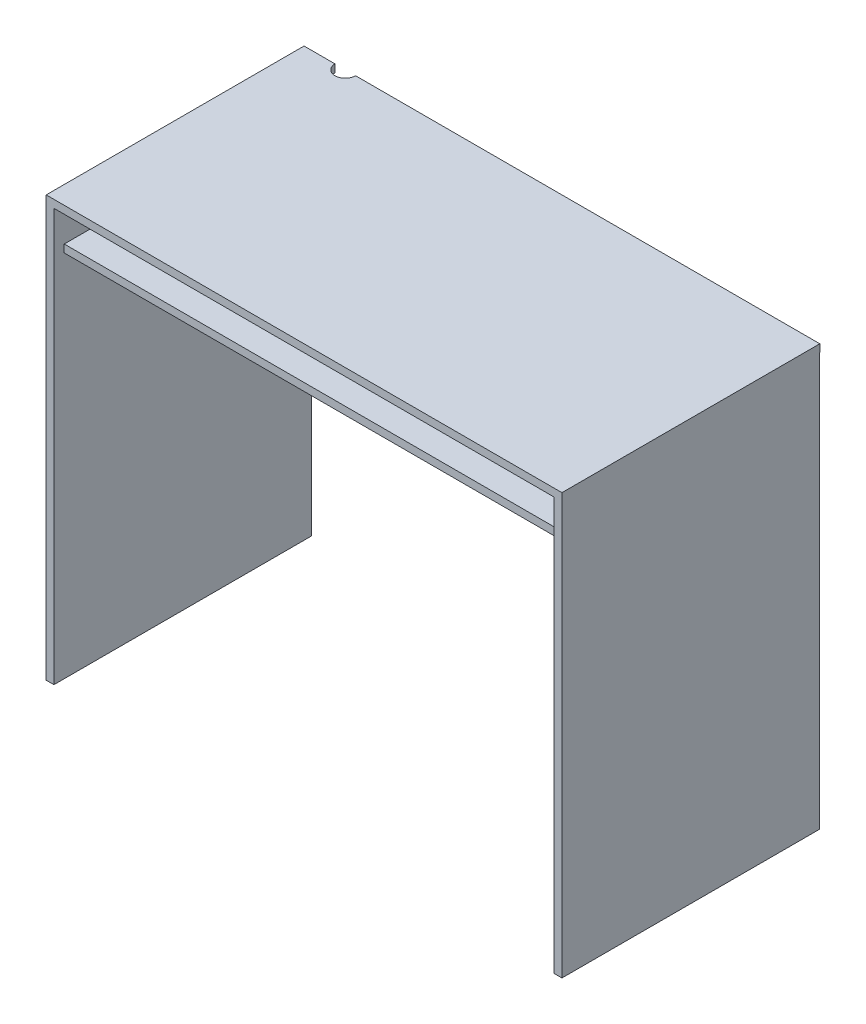
ISO-10303-21;
HEADER;
FILE_DESCRIPTION(('STEP AP214'),'2;1');
FILE_NAME('part.step','',(''),(''),'','','');
FILE_SCHEMA(('AUTOMOTIVE_DESIGN { 1 0 10303 214 1 1 1 1 }'));
ENDSEC;
DATA;
#1=APPLICATION_CONTEXT('core data for automotive mechanical design processes');
#2=APPLICATION_PROTOCOL_DEFINITION('international standard','automotive_design',2000,#1);
#3=PRODUCT_CONTEXT('',#1,'mechanical');
#4=PRODUCT('Part','Part','',(#3));
#5=PRODUCT_RELATED_PRODUCT_CATEGORY('part','',(#4));
#6=PRODUCT_DEFINITION_FORMATION('','',#4);
#7=PRODUCT_DEFINITION_CONTEXT('part definition',#1,'design');
#8=PRODUCT_DEFINITION('design','',#6,#7);
#9=PRODUCT_DEFINITION_SHAPE('','',#8);
#10=(LENGTH_UNIT() NAMED_UNIT(*) SI_UNIT(.MILLI.,.METRE.));
#11=(NAMED_UNIT(*) PLANE_ANGLE_UNIT() SI_UNIT($,.RADIAN.));
#12=(NAMED_UNIT(*) SI_UNIT($,.STERADIAN.) SOLID_ANGLE_UNIT());
#13=UNCERTAINTY_MEASURE_WITH_UNIT(LENGTH_MEASURE(1.E-05),#10,'distance_accuracy_value','');
#14=(GEOMETRIC_REPRESENTATION_CONTEXT(3) GLOBAL_UNCERTAINTY_ASSIGNED_CONTEXT((#13)) GLOBAL_UNIT_ASSIGNED_CONTEXT((#10,
#11,#12)) REPRESENTATION_CONTEXT('',''));
#15=CARTESIAN_POINT('',(0.,0.,0.));
#16=DIRECTION('',(0.,0.,1.));
#17=DIRECTION('',(1.,0.,0.));
#18=AXIS2_PLACEMENT_3D('',#15,#16,#17);
#19=CARTESIAN_POINT('',(-500.,15.,-250.));
#20=DIRECTION('',(0.,0.,1.));
#21=DIRECTION('',(1.,0.,0.));
#22=AXIS2_PLACEMENT_3D('',#19,#20,#21);
#23=PLANE('',#22);
#24=DIRECTION('',(-1.,0.,0.));
#25=VECTOR('',#24,1.);
#26=CARTESIAN_POINT('',(-500.,0.,-250.));
#27=LINE('',#26,#25);
#28=CARTESIAN_POINT('',(500.,0.,-250.));
#29=VERTEX_POINT('',#28);
#30=CARTESIAN_POINT('',(-400.,0.,-250.));
#31=VERTEX_POINT('',#30);
#32=EDGE_CURVE('E162',#29,#31,#27,.T.);
#33=ORIENTED_EDGE('',*,*,#32,.T.);
#34=DIRECTION('',(0.,1.,0.));
#35=VECTOR('',#34,1.);
#36=CARTESIAN_POINT('',(-400.,-800.,-250.));
#37=LINE('',#36,#35);
#38=CARTESIAN_POINT('',(-400.,15.,-250.));
#39=VERTEX_POINT('',#38);
#40=EDGE_CURVE('E151',#31,#39,#37,.T.);
#41=ORIENTED_EDGE('',*,*,#40,.T.);
#42=DIRECTION('',(-1.,0.,0.));
#43=VECTOR('',#42,1.);
#44=CARTESIAN_POINT('',(-500.,15.,-250.));
#45=LINE('',#44,#43);
#46=CARTESIAN_POINT('',(500.,15.,-250.));
#47=VERTEX_POINT('',#46);
#48=EDGE_CURVE('E159',#47,#39,#45,.T.);
#49=ORIENTED_EDGE('',*,*,#48,.F.);
#50=DIRECTION('',(0.,-1.,0.));
#51=VECTOR('',#50,1.);
#52=CARTESIAN_POINT('',(500.,15.,-250.));
#53=LINE('',#52,#51);
#54=EDGE_CURVE('E48',#47,#29,#53,.T.);
#55=ORIENTED_EDGE('',*,*,#54,.T.);
#56=EDGE_LOOP('',(#33,#41,#49,#55));
#57=FACE_BOUND('',#56,.T.);
#58=ADVANCED_FACE('F39',(#57),#23,.F.);
#59=CARTESIAN_POINT('',(-485.,-800.,250.));
#60=DIRECTION('',(-1.,0.,0.));
#61=DIRECTION('',(0.,0.,1.));
#62=AXIS2_PLACEMENT_3D('',#59,#60,#61);
#63=PLANE('',#62);
#64=DIRECTION('',(0.,0.,1.));
#65=VECTOR('',#64,1.);
#66=CARTESIAN_POINT('',(-485.,0.,250.));
#67=LINE('',#66,#65);
#68=CARTESIAN_POINT('',(-485.,0.,-249.509580663374));
#69=VERTEX_POINT('',#68);
#70=CARTESIAN_POINT('',(-485.,0.,250.));
#71=VERTEX_POINT('',#70);
#72=EDGE_CURVE('E299',#69,#71,#67,.T.);
#73=ORIENTED_EDGE('',*,*,#72,.T.);
#74=DIRECTION('',(0.,1.,0.));
#75=VECTOR('',#74,1.);
#76=CARTESIAN_POINT('',(-485.,-800.,250.));
#77=LINE('',#76,#75);
#78=CARTESIAN_POINT('',(-485.,-800.,250.));
#79=VERTEX_POINT('',#78);
#80=EDGE_CURVE('E309',#79,#71,#77,.T.);
#81=ORIENTED_EDGE('',*,*,#80,.F.);
#82=DIRECTION('',(0.,0.,1.));
#83=VECTOR('',#82,1.);
#84=CARTESIAN_POINT('',(-485.,-800.,250.));
#85=LINE('',#84,#83);
#86=CARTESIAN_POINT('',(-485.,-800.,-249.509580663374));
#87=VERTEX_POINT('',#86);
#88=EDGE_CURVE('E302',#87,#79,#85,.T.);
#89=ORIENTED_EDGE('',*,*,#88,.F.);
#90=DIRECTION('',(0.,1.,0.));
#91=VECTOR('',#90,1.);
#92=CARTESIAN_POINT('',(-485.,-800.,-249.509580663374));
#93=LINE('',#92,#91);
#94=EDGE_CURVE('E319',#87,#69,#93,.T.);
#95=ORIENTED_EDGE('',*,*,#94,.T.);
#96=EDGE_LOOP('',(#73,#81,#89,#95));
#97=FACE_BOUND('',#96,.T.);
#98=DIRECTION('',(0.,1.,0.));
#99=VECTOR('',#98,1.);
#100=CARTESIAN_POINT('',(-485.,-69.9999999999999,-229.509580663374));
#101=LINE('',#100,#99);
#102=CARTESIAN_POINT('',(-485.,-84.9999999999999,-229.509580663374));
#103=VERTEX_POINT('',#102);
#104=CARTESIAN_POINT('',(-485.,-70.,-229.509580663374));
#105=VERTEX_POINT('',#104);
#106=EDGE_CURVE('E62',#103,#105,#101,.T.);
#107=ORIENTED_EDGE('',*,*,#106,.F.);
#108=DIRECTION('',(0.,0.,-1.));
#109=VECTOR('',#108,1.);
#110=CARTESIAN_POINT('',(-485.,-85.,230.));
#111=LINE('',#110,#109);
#112=CARTESIAN_POINT('',(-485.,-85.,230.));
#113=VERTEX_POINT('',#112);
#114=EDGE_CURVE('E230',#113,#103,#111,.T.);
#115=ORIENTED_EDGE('',*,*,#114,.F.);
#116=DIRECTION('',(0.,-1.,0.));
#117=VECTOR('',#116,1.);
#118=CARTESIAN_POINT('',(-485.,-70.,230.));
#119=LINE('',#118,#117);
#120=CARTESIAN_POINT('',(-485.,-70.0000000000001,230.));
#121=VERTEX_POINT('',#120);
#122=EDGE_CURVE('E225',#121,#113,#119,.T.);
#123=ORIENTED_EDGE('',*,*,#122,.F.);
#124=DIRECTION('',(0.,0.,1.));
#125=VECTOR('',#124,1.);
#126=CARTESIAN_POINT('',(-485.,-70.,230.));
#127=LINE('',#126,#125);
#128=EDGE_CURVE('E164',#105,#121,#127,.T.);
#129=ORIENTED_EDGE('',*,*,#128,.F.);
#130=EDGE_LOOP('',(#107,#115,#123,#129));
#131=FACE_BOUND('',#130,.T.);
#132=ADVANCED_FACE('F337',(#97,#131),#63,.F.);
#133=CARTESIAN_POINT('',(485.,-800.,250.));
#134=DIRECTION('',(1.,0.,0.));
#135=DIRECTION('',(0.,0.,-1.));
#136=AXIS2_PLACEMENT_3D('',#133,#134,#135);
#137=PLANE('',#136);
#138=DIRECTION('',(0.,0.,-1.));
#139=VECTOR('',#138,1.);
#140=CARTESIAN_POINT('',(485.,0.,250.));
#141=LINE('',#140,#139);
#142=CARTESIAN_POINT('',(485.,0.,250.));
#143=VERTEX_POINT('',#142);
#144=CARTESIAN_POINT('',(485.,0.,-249.509580663374));
#145=VERTEX_POINT('',#144);
#146=EDGE_CURVE('E257',#143,#145,#141,.T.);
#147=ORIENTED_EDGE('',*,*,#146,.T.);
#148=DIRECTION('',(0.,1.,0.));
#149=VECTOR('',#148,1.);
#150=CARTESIAN_POINT('',(485.,-800.,-249.509580663374));
#151=LINE('',#150,#149);
#152=CARTESIAN_POINT('',(485.,-800.,-249.509580663374));
#153=VERTEX_POINT('',#152);
#154=EDGE_CURVE('E287',#153,#145,#151,.T.);
#155=ORIENTED_EDGE('',*,*,#154,.F.);
#156=DIRECTION('',(0.,0.,-1.));
#157=VECTOR('',#156,1.);
#158=CARTESIAN_POINT('',(485.,-800.,250.));
#159=LINE('',#158,#157);
#160=CARTESIAN_POINT('',(485.,-800.,250.));
#161=VERTEX_POINT('',#160);
#162=EDGE_CURVE('E274',#161,#153,#159,.T.);
#163=ORIENTED_EDGE('',*,*,#162,.F.);
#164=DIRECTION('',(0.,1.,0.));
#165=VECTOR('',#164,1.);
#166=CARTESIAN_POINT('',(485.,-800.,250.));
#167=LINE('',#166,#165);
#168=EDGE_CURVE('E290',#161,#143,#167,.T.);
#169=ORIENTED_EDGE('',*,*,#168,.T.);
#170=EDGE_LOOP('',(#147,#155,#163,#169));
#171=FACE_BOUND('',#170,.T.);
#172=DIRECTION('',(0.,1.,0.));
#173=VECTOR('',#172,1.);
#174=CARTESIAN_POINT('',(485.,-69.9999999999999,-229.509580663374));
#175=LINE('',#174,#173);
#176=CARTESIAN_POINT('',(485.,-84.9999999999999,-229.509580663374));
#177=VERTEX_POINT('',#176);
#178=CARTESIAN_POINT('',(485.,-70.,-229.509580663374));
#179=VERTEX_POINT('',#178);
#180=EDGE_CURVE('E254',#177,#179,#175,.T.);
#181=ORIENTED_EDGE('',*,*,#180,.T.);
#182=DIRECTION('',(0.,0.,1.));
#183=VECTOR('',#182,1.);
#184=CARTESIAN_POINT('',(485.,-70.,230.));
#185=LINE('',#184,#183);
#186=CARTESIAN_POINT('',(485.,-70.,230.));
#187=VERTEX_POINT('',#186);
#188=EDGE_CURVE('E253',#179,#187,#185,.T.);
#189=ORIENTED_EDGE('',*,*,#188,.T.);
#190=DIRECTION('',(0.,-1.,0.));
#191=VECTOR('',#190,1.);
#192=CARTESIAN_POINT('',(485.,-70.,230.));
#193=LINE('',#192,#191);
#194=CARTESIAN_POINT('',(485.,-85.,230.));
#195=VERTEX_POINT('',#194);
#196=EDGE_CURVE('E261',#187,#195,#193,.T.);
#197=ORIENTED_EDGE('',*,*,#196,.T.);
#198=DIRECTION('',(0.,0.,-1.));
#199=VECTOR('',#198,1.);
#200=CARTESIAN_POINT('',(485.,-85.,230.));
#201=LINE('',#200,#199);
#202=EDGE_CURVE('E258',#195,#177,#201,.T.);
#203=ORIENTED_EDGE('',*,*,#202,.T.);
#204=EDGE_LOOP('',(#181,#189,#197,#203));
#205=FACE_BOUND('',#204,.T.);
#206=ADVANCED_FACE('F364',(#171,#205),#137,.F.);
#207=CARTESIAN_POINT('',(0.,0.,0.));
#208=DIRECTION('',(0.,-1.,0.));
#209=DIRECTION('',(0.,0.,-1.));
#210=AXIS2_PLACEMENT_3D('',#207,#208,#209);
#211=PLANE('',#210);
#212=CARTESIAN_POINT('',(-420.,0.,-250.));
#213=DIRECTION('',(0.,-1.,0.));
#214=DIRECTION('',(0.,0.,-1.));
#215=AXIS2_PLACEMENT_3D('',#212,#213,#214);
#216=CIRCLE('',#215,20.);
#217=CARTESIAN_POINT('',(-440.,0.,-250.));
#218=VERTEX_POINT('',#217);
#219=EDGE_CURVE('E165',#31,#218,#216,.T.);
#220=ORIENTED_EDGE('',*,*,#219,.F.);
#221=ORIENTED_EDGE('',*,*,#32,.F.);
#222=DIRECTION('',(0.,0.,-1.));
#223=VECTOR('',#222,1.);
#224=CARTESIAN_POINT('',(500.,0.,250.));
#225=LINE('',#224,#223);
#226=CARTESIAN_POINT('',(500.,0.,-249.509580663374));
#227=VERTEX_POINT('',#226);
#228=EDGE_CURVE('E185',#227,#29,#225,.T.);
#229=ORIENTED_EDGE('',*,*,#228,.F.);
#230=DIRECTION('',(1.,0.,0.));
#231=VECTOR('',#230,1.);
#232=CARTESIAN_POINT('',(500.,0.,-249.509580663374));
#233=LINE('',#232,#231);
#234=EDGE_CURVE('E271',#145,#227,#233,.T.);
#235=ORIENTED_EDGE('',*,*,#234,.F.);
#236=ORIENTED_EDGE('',*,*,#146,.F.);
#237=DIRECTION('',(1.,0.,0.));
#238=VECTOR('',#237,1.);
#239=CARTESIAN_POINT('',(-500.,0.,250.));
#240=LINE('',#239,#238);
#241=EDGE_CURVE('E196',#71,#143,#240,.T.);
#242=ORIENTED_EDGE('',*,*,#241,.F.);
#243=ORIENTED_EDGE('',*,*,#72,.F.);
#244=DIRECTION('',(1.,0.,0.));
#245=VECTOR('',#244,1.);
#246=CARTESIAN_POINT('',(-500.,0.,-249.509580663374));
#247=LINE('',#246,#245);
#248=CARTESIAN_POINT('',(-500.,0.,-249.509580663374));
#249=VERTEX_POINT('',#248);
#250=EDGE_CURVE('E293',#249,#69,#247,.T.);
#251=ORIENTED_EDGE('',*,*,#250,.F.);
#252=DIRECTION('',(0.,0.,1.));
#253=VECTOR('',#252,1.);
#254=CARTESIAN_POINT('',(-500.,0.,250.));
#255=LINE('',#254,#253);
#256=CARTESIAN_POINT('',(-500.,0.,-250.));
#257=VERTEX_POINT('',#256);
#258=EDGE_CURVE('E192',#257,#249,#255,.T.);
#259=ORIENTED_EDGE('',*,*,#258,.F.);
#260=EDGE_CURVE('E188',#218,#257,#27,.T.);
#261=ORIENTED_EDGE('',*,*,#260,.F.);
#262=EDGE_LOOP('',(#220,#221,#229,#235,#236,#242,#243,#251,#259,#261));
#263=FACE_BOUND('',#262,.T.);
#264=ADVANCED_FACE('F217',(#263),#211,.T.);
#265=CARTESIAN_POINT('',(500.,15.,250.));
#266=DIRECTION('',(-1.,0.,0.));
#267=DIRECTION('',(0.,0.,1.));
#268=AXIS2_PLACEMENT_3D('',#265,#266,#267);
#269=PLANE('',#268);
#270=DIRECTION('',(0.,-1.,0.));
#271=VECTOR('',#270,1.);
#272=CARTESIAN_POINT('',(500.,15.,250.));
#273=LINE('',#272,#271);
#274=CARTESIAN_POINT('',(500.,15.,250.));
#275=VERTEX_POINT('',#274);
#276=CARTESIAN_POINT('',(500.,-800.,250.));
#277=VERTEX_POINT('',#276);
#278=EDGE_CURVE('E184',#275,#277,#273,.T.);
#279=ORIENTED_EDGE('',*,*,#278,.T.);
#280=DIRECTION('',(0.,0.,1.));
#281=VECTOR('',#280,1.);
#282=CARTESIAN_POINT('',(500.,-800.,250.));
#283=LINE('',#282,#281);
#284=CARTESIAN_POINT('',(500.,-800.,-249.509580663374));
#285=VERTEX_POINT('',#284);
#286=EDGE_CURVE('E266',#285,#277,#283,.T.);
#287=ORIENTED_EDGE('',*,*,#286,.F.);
#288=DIRECTION('',(0.,1.,0.));
#289=VECTOR('',#288,1.);
#290=CARTESIAN_POINT('',(500.,-800.,-249.509580663374));
#291=LINE('',#290,#289);
#292=EDGE_CURVE('E214',#285,#227,#291,.T.);
#293=ORIENTED_EDGE('',*,*,#292,.T.);
#294=ORIENTED_EDGE('',*,*,#228,.T.);
#295=ORIENTED_EDGE('',*,*,#54,.F.);
#296=DIRECTION('',(0.,0.,-1.));
#297=VECTOR('',#296,1.);
#298=CARTESIAN_POINT('',(500.,15.,250.));
#299=LINE('',#298,#297);
#300=EDGE_CURVE('E169',#275,#47,#299,.T.);
#301=ORIENTED_EDGE('',*,*,#300,.F.);
#302=EDGE_LOOP('',(#279,#287,#293,#294,#295,#301));
#303=FACE_BOUND('',#302,.T.);
#304=ADVANCED_FACE('F41',(#303),#269,.F.);
#305=CARTESIAN_POINT('',(-440.,15.,-250.));
#306=VERTEX_POINT('',#305);
#307=CARTESIAN_POINT('',(-500.,15.,-250.));
#308=VERTEX_POINT('',#307);
#309=EDGE_CURVE('E173',#306,#308,#45,.T.);
#310=ORIENTED_EDGE('',*,*,#309,.F.);
#311=DIRECTION('',(0.,1.,0.));
#312=VECTOR('',#311,1.);
#313=CARTESIAN_POINT('',(-440.,-800.,-250.));
#314=LINE('',#313,#312);
#315=EDGE_CURVE('E55',#306,#218,#314,.F.);
#316=ORIENTED_EDGE('',*,*,#315,.T.);
#317=ORIENTED_EDGE('',*,*,#260,.T.);
#318=DIRECTION('',(0.,-1.,0.));
#319=VECTOR('',#318,1.);
#320=CARTESIAN_POINT('',(-500.,15.,-250.));
#321=LINE('',#320,#319);
#322=EDGE_CURVE('E205',#308,#257,#321,.T.);
#323=ORIENTED_EDGE('',*,*,#322,.F.);
#324=EDGE_LOOP('',(#310,#316,#317,#323));
#325=FACE_BOUND('',#324,.T.);
#326=ADVANCED_FACE('F360',(#325),#23,.F.);
#327=CARTESIAN_POINT('',(-500.,15.,250.));
#328=DIRECTION('',(1.,0.,0.));
#329=DIRECTION('',(0.,0.,-1.));
#330=AXIS2_PLACEMENT_3D('',#327,#328,#329);
#331=PLANE('',#330);
#332=ORIENTED_EDGE('',*,*,#258,.T.);
#333=DIRECTION('',(0.,1.,0.));
#334=VECTOR('',#333,1.);
#335=CARTESIAN_POINT('',(-500.,-800.,-249.509580663374));
#336=LINE('',#335,#334);
#337=CARTESIAN_POINT('',(-500.,-800.,-249.509580663374));
#338=VERTEX_POINT('',#337);
#339=EDGE_CURVE('E189',#338,#249,#336,.T.);
#340=ORIENTED_EDGE('',*,*,#339,.F.);
#341=DIRECTION('',(0.,0.,-1.));
#342=VECTOR('',#341,1.);
#343=CARTESIAN_POINT('',(-500.,-800.,250.));
#344=LINE('',#343,#342);
#345=CARTESIAN_POINT('',(-500.,-800.,250.));
#346=VERTEX_POINT('',#345);
#347=EDGE_CURVE('E294',#346,#338,#344,.T.);
#348=ORIENTED_EDGE('',*,*,#347,.F.);
#349=DIRECTION('',(0.,-1.,0.));
#350=VECTOR('',#349,1.);
#351=CARTESIAN_POINT('',(-500.,15.,250.));
#352=LINE('',#351,#350);
#353=CARTESIAN_POINT('',(-500.,15.,250.));
#354=VERTEX_POINT('',#353);
#355=EDGE_CURVE('E202',#354,#346,#352,.T.);
#356=ORIENTED_EDGE('',*,*,#355,.F.);
#357=DIRECTION('',(0.,0.,1.));
#358=VECTOR('',#357,1.);
#359=CARTESIAN_POINT('',(-500.,15.,250.));
#360=LINE('',#359,#358);
#361=EDGE_CURVE('E172',#308,#354,#360,.T.);
#362=ORIENTED_EDGE('',*,*,#361,.F.);
#363=ORIENTED_EDGE('',*,*,#322,.T.);
#364=EDGE_LOOP('',(#332,#340,#348,#356,#362,#363));
#365=FACE_BOUND('',#364,.T.);
#366=ADVANCED_FACE('F330',(#365),#331,.F.);
#367=CARTESIAN_POINT('',(-500.,15.,250.));
#368=DIRECTION('',(0.,0.,-1.));
#369=DIRECTION('',(-1.,0.,0.));
#370=AXIS2_PLACEMENT_3D('',#367,#368,#369);
#371=PLANE('',#370);
#372=ORIENTED_EDGE('',*,*,#355,.T.);
#373=DIRECTION('',(-1.,0.,0.));
#374=VECTOR('',#373,1.);
#375=CARTESIAN_POINT('',(-500.,-800.,250.));
#376=LINE('',#375,#374);
#377=EDGE_CURVE('E305',#79,#346,#376,.T.);
#378=ORIENTED_EDGE('',*,*,#377,.F.);
#379=ORIENTED_EDGE('',*,*,#80,.T.);
#380=ORIENTED_EDGE('',*,*,#241,.T.);
#381=ORIENTED_EDGE('',*,*,#168,.F.);
#382=DIRECTION('',(-1.,0.,0.));
#383=VECTOR('',#382,1.);
#384=CARTESIAN_POINT('',(500.,-800.,250.));
#385=LINE('',#384,#383);
#386=EDGE_CURVE('E270',#277,#161,#385,.T.);
#387=ORIENTED_EDGE('',*,*,#386,.F.);
#388=ORIENTED_EDGE('',*,*,#278,.F.);
#389=DIRECTION('',(1.,0.,0.));
#390=VECTOR('',#389,1.);
#391=CARTESIAN_POINT('',(-500.,15.,250.));
#392=LINE('',#391,#390);
#393=EDGE_CURVE('E177',#354,#275,#392,.T.);
#394=ORIENTED_EDGE('',*,*,#393,.F.);
#395=EDGE_LOOP('',(#372,#378,#379,#380,#381,#387,#388,#394));
#396=FACE_BOUND('',#395,.T.);
#397=ADVANCED_FACE('F341',(#396),#371,.F.);
#398=CARTESIAN_POINT('',(0.,15.,0.));
#399=DIRECTION('',(0.,-1.,0.));
#400=DIRECTION('',(0.,0.,-1.));
#401=AXIS2_PLACEMENT_3D('',#398,#399,#400);
#402=PLANE('',#401);
#403=ORIENTED_EDGE('',*,*,#48,.T.);
#404=CARTESIAN_POINT('',(-420.,15.,-250.));
#405=DIRECTION('',(0.,-1.,0.));
#406=DIRECTION('',(0.,0.,-1.));
#407=AXIS2_PLACEMENT_3D('',#404,#405,#406);
#408=CIRCLE('',#407,20.);
#409=EDGE_CURVE('E11',#39,#306,#408,.T.);
#410=ORIENTED_EDGE('',*,*,#409,.T.);
#411=ORIENTED_EDGE('',*,*,#309,.T.);
#412=ORIENTED_EDGE('',*,*,#361,.T.);
#413=ORIENTED_EDGE('',*,*,#393,.T.);
#414=ORIENTED_EDGE('',*,*,#300,.T.);
#415=EDGE_LOOP('',(#403,#410,#411,#412,#413,#414));
#416=FACE_BOUND('',#415,.T.);
#417=ADVANCED_FACE('F167',(#416),#402,.F.);
#418=CARTESIAN_POINT('',(-500.,-800.,-249.509580663374));
#419=DIRECTION('',(0.,0.,1.));
#420=DIRECTION('',(1.,0.,0.));
#421=AXIS2_PLACEMENT_3D('',#418,#419,#420);
#422=PLANE('',#421);
#423=ORIENTED_EDGE('',*,*,#250,.T.);
#424=ORIENTED_EDGE('',*,*,#94,.F.);
#425=DIRECTION('',(1.,0.,0.));
#426=VECTOR('',#425,1.);
#427=CARTESIAN_POINT('',(-500.,-800.,-249.509580663374));
#428=LINE('',#427,#426);
#429=EDGE_CURVE('E298',#338,#87,#428,.T.);
#430=ORIENTED_EDGE('',*,*,#429,.F.);
#431=ORIENTED_EDGE('',*,*,#339,.T.);
#432=EDGE_LOOP('',(#423,#424,#430,#431));
#433=FACE_BOUND('',#432,.T.);
#434=ADVANCED_FACE('F326',(#433),#422,.F.);
#435=CARTESIAN_POINT('',(0.,-800.,0.));
#436=DIRECTION('',(0.,-1.,0.));
#437=DIRECTION('',(0.,0.,-1.));
#438=AXIS2_PLACEMENT_3D('',#435,#436,#437);
#439=PLANE('',#438);
#440=ORIENTED_EDGE('',*,*,#347,.T.);
#441=ORIENTED_EDGE('',*,*,#429,.T.);
#442=ORIENTED_EDGE('',*,*,#88,.T.);
#443=ORIENTED_EDGE('',*,*,#377,.T.);
#444=EDGE_LOOP('',(#440,#441,#442,#443));
#445=FACE_BOUND('',#444,.T.);
#446=ADVANCED_FACE('F345',(#445),#439,.T.);
#447=CARTESIAN_POINT('',(500.,-800.,-249.509580663374));
#448=DIRECTION('',(0.,0.,1.));
#449=DIRECTION('',(1.,0.,0.));
#450=AXIS2_PLACEMENT_3D('',#447,#448,#449);
#451=PLANE('',#450);
#452=ORIENTED_EDGE('',*,*,#234,.T.);
#453=ORIENTED_EDGE('',*,*,#292,.F.);
#454=DIRECTION('',(1.,0.,0.));
#455=VECTOR('',#454,1.);
#456=CARTESIAN_POINT('',(500.,-800.,-249.509580663374));
#457=LINE('',#456,#455);
#458=EDGE_CURVE('E277',#153,#285,#457,.T.);
#459=ORIENTED_EDGE('',*,*,#458,.F.);
#460=ORIENTED_EDGE('',*,*,#154,.T.);
#461=EDGE_LOOP('',(#452,#453,#459,#460));
#462=FACE_BOUND('',#461,.T.);
#463=ADVANCED_FACE('F347',(#462),#451,.F.);
#464=CARTESIAN_POINT('',(0.,-800.,0.));
#465=DIRECTION('',(0.,1.,0.));
#466=DIRECTION('',(0.,0.,1.));
#467=AXIS2_PLACEMENT_3D('',#464,#465,#466);
#468=PLANE('',#467);
#469=ORIENTED_EDGE('',*,*,#286,.T.);
#470=ORIENTED_EDGE('',*,*,#386,.T.);
#471=ORIENTED_EDGE('',*,*,#162,.T.);
#472=ORIENTED_EDGE('',*,*,#458,.T.);
#473=EDGE_LOOP('',(#469,#470,#471,#472));
#474=FACE_BOUND('',#473,.T.);
#475=ADVANCED_FACE('F353',(#474),#468,.F.);
#476=CARTESIAN_POINT('',(500.002,-69.9999999999999,-229.509580663374));
#477=DIRECTION('',(0.,0.,1.));
#478=DIRECTION('',(1.,0.,0.));
#479=AXIS2_PLACEMENT_3D('',#476,#477,#478);
#480=PLANE('',#479);
#481=ORIENTED_EDGE('',*,*,#180,.F.);
#482=DIRECTION('',(-1.,0.,0.));
#483=VECTOR('',#482,1.);
#484=CARTESIAN_POINT('',(500.002,-84.9999999999999,-229.509580663374));
#485=LINE('',#484,#483);
#486=EDGE_CURVE('E242',#177,#103,#485,.T.);
#487=ORIENTED_EDGE('',*,*,#486,.T.);
#488=ORIENTED_EDGE('',*,*,#106,.T.);
#489=DIRECTION('',(-1.,0.,0.));
#490=VECTOR('',#489,1.);
#491=CARTESIAN_POINT('',(500.002,-69.9999999999999,-229.509580663374));
#492=LINE('',#491,#490);
#493=EDGE_CURVE('E229',#179,#105,#492,.T.);
#494=ORIENTED_EDGE('',*,*,#493,.F.);
#495=EDGE_LOOP('',(#481,#487,#488,#494));
#496=FACE_BOUND('',#495,.T.);
#497=ADVANCED_FACE('F391',(#496),#480,.F.);
#498=CARTESIAN_POINT('',(500.002,-85.,230.));
#499=DIRECTION('',(0.,1.,0.));
#500=DIRECTION('',(0.,0.,1.));
#501=AXIS2_PLACEMENT_3D('',#498,#499,#500);
#502=PLANE('',#501);
#503=ORIENTED_EDGE('',*,*,#202,.F.);
#504=DIRECTION('',(-1.,0.,0.));
#505=VECTOR('',#504,1.);
#506=CARTESIAN_POINT('',(500.002,-85.,230.));
#507=LINE('',#506,#505);
#508=EDGE_CURVE('E245',#195,#113,#507,.T.);
#509=ORIENTED_EDGE('',*,*,#508,.T.);
#510=ORIENTED_EDGE('',*,*,#114,.T.);
#511=ORIENTED_EDGE('',*,*,#486,.F.);
#512=EDGE_LOOP('',(#503,#509,#510,#511));
#513=FACE_BOUND('',#512,.T.);
#514=ADVANCED_FACE('F393',(#513),#502,.F.);
#515=CARTESIAN_POINT('',(500.002,-70.,230.));
#516=DIRECTION('',(0.,-1.,0.));
#517=DIRECTION('',(0.,0.,-1.));
#518=AXIS2_PLACEMENT_3D('',#515,#516,#517);
#519=PLANE('',#518);
#520=ORIENTED_EDGE('',*,*,#188,.F.);
#521=ORIENTED_EDGE('',*,*,#493,.T.);
#522=ORIENTED_EDGE('',*,*,#128,.T.);
#523=DIRECTION('',(-1.,0.,0.));
#524=VECTOR('',#523,1.);
#525=CARTESIAN_POINT('',(500.002,-70.,230.));
#526=LINE('',#525,#524);
#527=EDGE_CURVE('E249',#187,#121,#526,.T.);
#528=ORIENTED_EDGE('',*,*,#527,.F.);
#529=EDGE_LOOP('',(#520,#521,#522,#528));
#530=FACE_BOUND('',#529,.T.);
#531=ADVANCED_FACE('F390',(#530),#519,.F.);
#532=CARTESIAN_POINT('',(500.002,-70.,230.));
#533=DIRECTION('',(0.,0.,-1.));
#534=DIRECTION('',(-1.,0.,0.));
#535=AXIS2_PLACEMENT_3D('',#532,#533,#534);
#536=PLANE('',#535);
#537=ORIENTED_EDGE('',*,*,#196,.F.);
#538=ORIENTED_EDGE('',*,*,#527,.T.);
#539=ORIENTED_EDGE('',*,*,#122,.T.);
#540=ORIENTED_EDGE('',*,*,#508,.F.);
#541=EDGE_LOOP('',(#537,#538,#539,#540));
#542=FACE_BOUND('',#541,.T.);
#543=ADVANCED_FACE('F396',(#542),#536,.F.);
#544=CARTESIAN_POINT('',(-420.,-800.,-250.));
#545=DIRECTION('',(0.,1.,0.));
#546=DIRECTION('',(0.,0.,1.));
#547=AXIS2_PLACEMENT_3D('',#544,#545,#546);
#548=CYLINDRICAL_SURFACE('',#547,20.);
#549=ORIENTED_EDGE('',*,*,#219,.T.);
#550=ORIENTED_EDGE('',*,*,#315,.F.);
#551=ORIENTED_EDGE('',*,*,#409,.F.);
#552=ORIENTED_EDGE('',*,*,#40,.F.);
#553=EDGE_LOOP('',(#549,#550,#551,#552));
#554=FACE_BOUND('',#553,.T.);
#555=ADVANCED_FACE('F150',(#554),#548,.F.);
#556=CLOSED_SHELL('',(#58,#132,#206,#264,#304,#326,#366,#397,#417,#434,#446,#463,#475,#497,#514,
#531,#543,#555));
#557=MANIFOLD_SOLID_BREP('B2',#556);
#558=ADVANCED_BREP_SHAPE_REPRESENTATION('',(#18,#557),#14);
#559=SHAPE_DEFINITION_REPRESENTATION(#9,#558);
ENDSEC;
END-ISO-10303-21;
